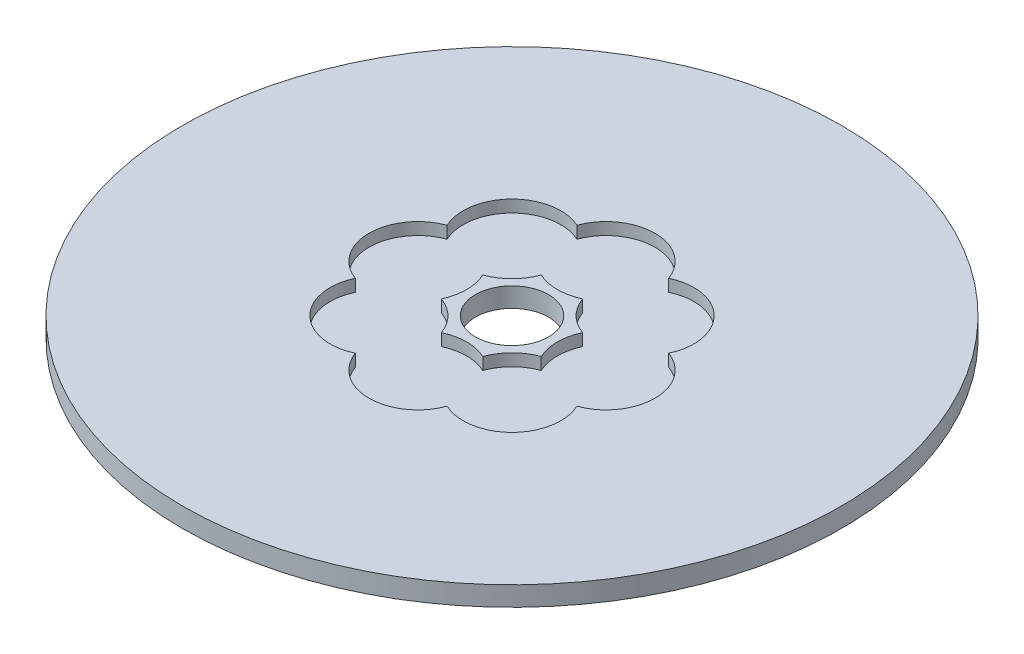
ISO-10303-21;
HEADER;
FILE_DESCRIPTION(('STEP AP214'),'2;1');
FILE_NAME('part.step','',(''),(''),'','','');
FILE_SCHEMA(('AUTOMOTIVE_DESIGN { 1 0 10303 214 1 1 1 1 }'));
ENDSEC;
DATA;
#1=APPLICATION_CONTEXT('core data for automotive mechanical design processes');
#2=APPLICATION_PROTOCOL_DEFINITION('international standard','automotive_design',2000,#1);
#3=PRODUCT_CONTEXT('',#1,'mechanical');
#4=PRODUCT('Part','Part','',(#3));
#5=PRODUCT_RELATED_PRODUCT_CATEGORY('part','',(#4));
#6=PRODUCT_DEFINITION_FORMATION('','',#4);
#7=PRODUCT_DEFINITION_CONTEXT('part definition',#1,'design');
#8=PRODUCT_DEFINITION('design','',#6,#7);
#9=PRODUCT_DEFINITION_SHAPE('','',#8);
#10=(LENGTH_UNIT() NAMED_UNIT(*) SI_UNIT(.MILLI.,.METRE.));
#11=(NAMED_UNIT(*) PLANE_ANGLE_UNIT() SI_UNIT($,.RADIAN.));
#12=(NAMED_UNIT(*) SI_UNIT($,.STERADIAN.) SOLID_ANGLE_UNIT());
#13=UNCERTAINTY_MEASURE_WITH_UNIT(LENGTH_MEASURE(1.E-05),#10,'distance_accuracy_value','');
#14=(GEOMETRIC_REPRESENTATION_CONTEXT(3) GLOBAL_UNCERTAINTY_ASSIGNED_CONTEXT((#13)) GLOBAL_UNIT_ASSIGNED_CONTEXT((#10,
#11,#12)) REPRESENTATION_CONTEXT('',''));
#15=CARTESIAN_POINT('',(0.,0.,0.));
#16=DIRECTION('',(0.,0.,1.));
#17=DIRECTION('',(1.,0.,0.));
#18=AXIS2_PLACEMENT_3D('',#15,#16,#17);
#19=CARTESIAN_POINT('',(0.,4.,0.));
#20=DIRECTION('',(0.,1.,0.));
#21=DIRECTION('',(0.,0.,1.));
#22=AXIS2_PLACEMENT_3D('',#19,#20,#21);
#23=PLANE('',#22);
#24=CARTESIAN_POINT('',(-13.6332998933664,4.,13.6332998933664));
#25=DIRECTION('',(0.,1.,0.));
#26=DIRECTION('',(0.707106781186549,0.,0.707106781186546));
#27=AXIS2_PLACEMENT_3D('',#24,#25,#26);
#28=CIRCLE('',#27,10.);
#29=CARTESIAN_POINT('',(-4.23358339935689,4.,10.2207744601651));
#30=VERTEX_POINT('',#29);
#31=CARTESIAN_POINT('',(-10.2207744601651,4.,4.23358339935693));
#32=VERTEX_POINT('',#31);
#33=EDGE_CURVE('E249',#30,#32,#28,.T.);
#34=ORIENTED_EDGE('',*,*,#33,.F.);
#35=CARTESIAN_POINT('',(0.,4.,19.2803976090984));
#36=DIRECTION('',(0.,1.,0.));
#37=DIRECTION('',(1.,0.,0.));
#38=AXIS2_PLACEMENT_3D('',#35,#36,#37);
#39=CIRCLE('',#38,10.);
#40=CARTESIAN_POINT('',(4.23358339935697,4.,10.220774460165));
#41=VERTEX_POINT('',#40);
#42=EDGE_CURVE('E227',#41,#30,#39,.T.);
#43=ORIENTED_EDGE('',*,*,#42,.F.);
#44=CARTESIAN_POINT('',(13.6332998933665,4.,13.6332998933663));
#45=DIRECTION('',(0.,1.,0.));
#46=DIRECTION('',(0.707106781186544,0.,-0.707106781186551));
#47=AXIS2_PLACEMENT_3D('',#44,#45,#46);
#48=CIRCLE('',#47,10.);
#49=CARTESIAN_POINT('',(10.220774460165,4.,4.23358339935688));
#50=VERTEX_POINT('',#49);
#51=EDGE_CURVE('E202',#50,#41,#48,.T.);
#52=ORIENTED_EDGE('',*,*,#51,.F.);
#53=CARTESIAN_POINT('',(19.2803976090984,4.,0.));
#54=DIRECTION('',(0.,1.,0.));
#55=DIRECTION('',(0.,0.,-1.));
#56=AXIS2_PLACEMENT_3D('',#53,#54,#55);
#57=CIRCLE('',#56,10.);
#58=CARTESIAN_POINT('',(10.2207744601651,4.,-4.23358339935698));
#59=VERTEX_POINT('',#58);
#60=EDGE_CURVE('E210',#59,#50,#57,.T.);
#61=ORIENTED_EDGE('',*,*,#60,.F.);
#62=CARTESIAN_POINT('',(13.6332998933663,4.,-13.6332998933665));
#63=DIRECTION('',(0.,1.,0.));
#64=DIRECTION('',(-0.707106781186554,0.,-0.707106781186541));
#65=AXIS2_PLACEMENT_3D('',#62,#63,#64);
#66=CIRCLE('',#65,10.);
#67=CARTESIAN_POINT('',(4.23358339935682,4.,-10.2207744601651));
#68=VERTEX_POINT('',#67);
#69=EDGE_CURVE('E190',#68,#59,#66,.T.);
#70=ORIENTED_EDGE('',*,*,#69,.F.);
#71=CARTESIAN_POINT('',(-2.01951445372929E-13,4.,-19.2803976090984));
#72=DIRECTION('',(0.,1.,0.));
#73=DIRECTION('',(-1.,0.,0.));
#74=AXIS2_PLACEMENT_3D('',#71,#72,#73);
#75=CIRCLE('',#74,10.);
#76=CARTESIAN_POINT('',(-4.23358339935704,4.,-10.220774460165));
#77=VERTEX_POINT('',#76);
#78=EDGE_CURVE('E164',#77,#68,#75,.T.);
#79=ORIENTED_EDGE('',*,*,#78,.F.);
#80=CARTESIAN_POINT('',(-13.6332998933666,4.,-13.6332998933662));
#81=DIRECTION('',(0.,1.,0.));
#82=DIRECTION('',(-0.707106781186539,0.,0.707106781186556));
#83=AXIS2_PLACEMENT_3D('',#80,#81,#82);
#84=CIRCLE('',#83,10.);
#85=CARTESIAN_POINT('',(-10.220774460165,4.,-4.23358339935683));
#86=VERTEX_POINT('',#85);
#87=EDGE_CURVE('E185',#86,#77,#84,.T.);
#88=ORIENTED_EDGE('',*,*,#87,.F.);
#89=CARTESIAN_POINT('',(-19.2803976090984,4.,0.));
#90=DIRECTION('',(0.,1.,0.));
#91=DIRECTION('',(0.,0.,1.));
#92=AXIS2_PLACEMENT_3D('',#89,#90,#91);
#93=CIRCLE('',#92,10.);
#94=EDGE_CURVE('E262',#32,#86,#93,.T.);
#95=ORIENTED_EDGE('',*,*,#94,.F.);
#96=EDGE_LOOP('',(#34,#43,#52,#61,#70,#79,#88,#95));
#97=FACE_BOUND('',#96,.T.);
#98=CARTESIAN_POINT('',(0.,4.,0.));
#99=DIRECTION('',(0.,1.,0.));
#100=DIRECTION('',(0.,0.,1.));
#101=AXIS2_PLACEMENT_3D('',#98,#99,#100);
#102=CIRCLE('',#101,7.5);
#103=CARTESIAN_POINT('',(0.,4.,7.5));
#104=VERTEX_POINT('',#103);
#105=EDGE_CURVE('E270',#104,#104,#102,.T.);
#106=ORIENTED_EDGE('',*,*,#105,.F.);
#107=EDGE_LOOP('',(#106));
#108=FACE_BOUND('',#107,.T.);
#109=ADVANCED_FACE('F39',(#97,#108),#23,.T.);
#110=CARTESIAN_POINT('',(-19.2803976090984,1.51424646369114,0.));
#111=DIRECTION('',(0.,1.,0.));
#112=DIRECTION('',(0.,0.,1.));
#113=AXIS2_PLACEMENT_3D('',#110,#111,#112);
#114=CYLINDRICAL_SURFACE('',#113,10.);
#115=CARTESIAN_POINT('',(-19.2803976090984,1.51424646369114,0.));
#116=DIRECTION('',(0.,1.,0.));
#117=DIRECTION('',(0.,0.,1.));
#118=AXIS2_PLACEMENT_3D('',#115,#116,#117);
#119=CIRCLE('',#118,10.);
#120=CARTESIAN_POINT('',(-10.2207744601651,1.51424646369114,4.23358339935693));
#121=VERTEX_POINT('',#120);
#122=CARTESIAN_POINT('',(-10.220774460165,1.51424646369114,-4.23358339935683));
#123=VERTEX_POINT('',#122);
#124=EDGE_CURVE('E259',#121,#123,#119,.T.);
#125=ORIENTED_EDGE('',*,*,#124,.F.);
#126=DIRECTION('',(0.,1.,0.));
#127=VECTOR('',#126,1.);
#128=CARTESIAN_POINT('',(-10.2207744601651,2.75712323184557,4.23358339935693));
#129=LINE('',#128,#127);
#130=EDGE_CURVE('E254',#121,#32,#129,.T.);
#131=ORIENTED_EDGE('',*,*,#130,.T.);
#132=ORIENTED_EDGE('',*,*,#94,.T.);
#133=DIRECTION('',(0.,1.,0.));
#134=VECTOR('',#133,1.);
#135=CARTESIAN_POINT('',(-10.220774460165,2.75712323184557,-4.23358339935683));
#136=LINE('',#135,#134);
#137=EDGE_CURVE('E247',#86,#123,#136,.F.);
#138=ORIENTED_EDGE('',*,*,#137,.T.);
#139=EDGE_LOOP('',(#125,#131,#132,#138));
#140=FACE_BOUND('',#139,.T.);
#141=ADVANCED_FACE('F287',(#140),#114,.F.);
#142=CARTESIAN_POINT('',(0.,4.,0.));
#143=DIRECTION('',(0.,-1.,0.));
#144=DIRECTION('',(0.,0.,-1.));
#145=AXIS2_PLACEMENT_3D('',#142,#143,#144);
#146=CYLINDRICAL_SURFACE('',#145,67.5);
#147=CARTESIAN_POINT('',(0.,4.,0.));
#148=DIRECTION('',(0.,1.,0.));
#149=DIRECTION('',(0.,0.,1.));
#150=AXIS2_PLACEMENT_3D('',#147,#148,#149);
#151=CIRCLE('',#150,67.5);
#152=CARTESIAN_POINT('',(0.,4.,67.5));
#153=VERTEX_POINT('',#152);
#154=EDGE_CURVE('E11',#153,#153,#151,.T.);
#155=ORIENTED_EDGE('',*,*,#154,.F.);
#156=EDGE_LOOP('',(#155));
#157=FACE_BOUND('',#156,.T.);
#158=CARTESIAN_POINT('',(0.,0.,0.));
#159=DIRECTION('',(0.,1.,0.));
#160=DIRECTION('',(0.,0.,1.));
#161=AXIS2_PLACEMENT_3D('',#158,#159,#160);
#162=CIRCLE('',#161,67.5);
#163=CARTESIAN_POINT('',(0.,0.,67.5));
#164=VERTEX_POINT('',#163);
#165=EDGE_CURVE('E43',#164,#164,#162,.T.);
#166=ORIENTED_EDGE('',*,*,#165,.T.);
#167=EDGE_LOOP('',(#166));
#168=FACE_BOUND('',#167,.T.);
#169=ADVANCED_FACE('F41',(#157,#168),#146,.T.);
#170=CARTESIAN_POINT('',(-22.6929230422997,4.,9.3997164940095));
#171=VERTEX_POINT('',#170);
#172=CARTESIAN_POINT('',(-9.39971649400942,4.,22.6929230422998));
#173=VERTEX_POINT('',#172);
#174=EDGE_CURVE('E243',#171,#173,#28,.T.);
#175=ORIENTED_EDGE('',*,*,#174,.F.);
#176=CARTESIAN_POINT('',(-22.6929230423,4.,-9.39971649400941));
#177=VERTEX_POINT('',#176);
#178=EDGE_CURVE('E256',#177,#171,#93,.T.);
#179=ORIENTED_EDGE('',*,*,#178,.F.);
#180=CARTESIAN_POINT('',(-9.39971649400973,4.,-22.6929230422997));
#181=VERTEX_POINT('',#180);
#182=EDGE_CURVE('E179',#181,#177,#84,.T.);
#183=ORIENTED_EDGE('',*,*,#182,.F.);
#184=CARTESIAN_POINT('',(9.39971649400926,4.,-22.6929230422998));
#185=VERTEX_POINT('',#184);
#186=EDGE_CURVE('E171',#185,#181,#75,.T.);
#187=ORIENTED_EDGE('',*,*,#186,.F.);
#188=CARTESIAN_POINT('',(22.6929230422996,4.,-9.39971649400954));
#189=VERTEX_POINT('',#188);
#190=EDGE_CURVE('E192',#189,#185,#66,.T.);
#191=ORIENTED_EDGE('',*,*,#190,.F.);
#192=CARTESIAN_POINT('',(22.6929230422999,4.,9.39971649400945));
#193=VERTEX_POINT('',#192);
#194=EDGE_CURVE('E203',#193,#189,#57,.T.);
#195=ORIENTED_EDGE('',*,*,#194,.F.);
#196=CARTESIAN_POINT('',(9.39971649400958,4.,22.6929230422997));
#197=VERTEX_POINT('',#196);
#198=EDGE_CURVE('E212',#197,#193,#48,.T.);
#199=ORIENTED_EDGE('',*,*,#198,.F.);
#200=EDGE_CURVE('E225',#173,#197,#39,.T.);
#201=ORIENTED_EDGE('',*,*,#200,.F.);
#202=EDGE_LOOP('',(#175,#179,#183,#187,#191,#195,#199,#201));
#203=FACE_BOUND('',#202,.T.);
#204=ORIENTED_EDGE('',*,*,#154,.T.);
#205=EDGE_LOOP('',(#204));
#206=FACE_BOUND('',#205,.T.);
#207=ADVANCED_FACE('F288',(#203,#206),#23,.T.);
#208=CARTESIAN_POINT('',(0.,0.,0.));
#209=DIRECTION('',(0.,1.,0.));
#210=DIRECTION('',(0.,0.,1.));
#211=AXIS2_PLACEMENT_3D('',#208,#209,#210);
#212=PLANE('',#211);
#213=CARTESIAN_POINT('',(0.,0.,0.));
#214=DIRECTION('',(0.,1.,0.));
#215=DIRECTION('',(0.,0.,1.));
#216=AXIS2_PLACEMENT_3D('',#213,#214,#215);
#217=CIRCLE('',#216,7.5);
#218=CARTESIAN_POINT('',(0.,0.,7.5));
#219=VERTEX_POINT('',#218);
#220=EDGE_CURVE('E265',#219,#219,#217,.T.);
#221=ORIENTED_EDGE('',*,*,#220,.T.);
#222=EDGE_LOOP('',(#221));
#223=FACE_BOUND('',#222,.T.);
#224=ORIENTED_EDGE('',*,*,#165,.F.);
#225=EDGE_LOOP('',(#224));
#226=FACE_BOUND('',#225,.T.);
#227=ADVANCED_FACE('F272',(#223,#226),#212,.F.);
#228=CARTESIAN_POINT('',(0.,4.,0.));
#229=DIRECTION('',(0.,-1.,0.));
#230=DIRECTION('',(0.,0.,-1.));
#231=AXIS2_PLACEMENT_3D('',#228,#229,#230);
#232=CYLINDRICAL_SURFACE('',#231,7.5);
#233=ORIENTED_EDGE('',*,*,#105,.T.);
#234=EDGE_LOOP('',(#233));
#235=FACE_BOUND('',#234,.T.);
#236=ORIENTED_EDGE('',*,*,#220,.F.);
#237=EDGE_LOOP('',(#236));
#238=FACE_BOUND('',#237,.T.);
#239=ADVANCED_FACE('F277',(#235,#238),#232,.F.);
#240=ORIENTED_EDGE('',*,*,#178,.T.);
#241=DIRECTION('',(0.,1.,0.));
#242=VECTOR('',#241,1.);
#243=CARTESIAN_POINT('',(-22.6929230422997,2.75712323184557,9.3997164940095));
#244=LINE('',#243,#242);
#245=CARTESIAN_POINT('',(-22.6929230422997,1.51424646369114,9.3997164940095));
#246=VERTEX_POINT('',#245);
#247=EDGE_CURVE('E65',#171,#246,#244,.F.);
#248=ORIENTED_EDGE('',*,*,#247,.T.);
#249=CARTESIAN_POINT('',(-22.6929230423,1.51424646369114,-9.39971649400941));
#250=VERTEX_POINT('',#249);
#251=EDGE_CURVE('E263',#250,#246,#119,.T.);
#252=ORIENTED_EDGE('',*,*,#251,.F.);
#253=DIRECTION('',(0.,1.,0.));
#254=VECTOR('',#253,1.);
#255=CARTESIAN_POINT('',(-22.6929230423,2.75712323184557,-9.39971649400941));
#256=LINE('',#255,#254);
#257=EDGE_CURVE('E177',#250,#177,#256,.T.);
#258=ORIENTED_EDGE('',*,*,#257,.T.);
#259=EDGE_LOOP('',(#240,#248,#252,#258));
#260=FACE_BOUND('',#259,.T.);
#261=ADVANCED_FACE('F279',(#260),#114,.F.);
#262=CARTESIAN_POINT('',(-19.2803976090984,1.51424646369114,0.));
#263=DIRECTION('',(0.,1.,0.));
#264=DIRECTION('',(0.,0.,1.));
#265=AXIS2_PLACEMENT_3D('',#262,#263,#264);
#266=PLANE('',#265);
#267=CARTESIAN_POINT('',(-13.6332998933666,1.51424646369114,-13.6332998933662));
#268=DIRECTION('',(0.,1.,0.));
#269=DIRECTION('',(-0.707106781186539,0.,0.707106781186556));
#270=AXIS2_PLACEMENT_3D('',#267,#268,#269);
#271=CIRCLE('',#270,10.);
#272=CARTESIAN_POINT('',(-9.39971649400973,1.51424646369114,-22.6929230422997));
#273=VERTEX_POINT('',#272);
#274=EDGE_CURVE('E158',#273,#250,#271,.T.);
#275=ORIENTED_EDGE('',*,*,#274,.T.);
#276=ORIENTED_EDGE('',*,*,#251,.T.);
#277=CARTESIAN_POINT('',(-13.6332998933664,1.51424646369114,13.6332998933664));
#278=DIRECTION('',(0.,1.,0.));
#279=DIRECTION('',(0.707106781186549,0.,0.707106781186546));
#280=AXIS2_PLACEMENT_3D('',#277,#278,#279);
#281=CIRCLE('',#280,10.);
#282=CARTESIAN_POINT('',(-9.39971649400942,1.51424646369114,22.6929230422998));
#283=VERTEX_POINT('',#282);
#284=EDGE_CURVE('E248',#246,#283,#281,.T.);
#285=ORIENTED_EDGE('',*,*,#284,.T.);
#286=CARTESIAN_POINT('',(0.,1.51424646369114,19.2803976090984));
#287=DIRECTION('',(0.,1.,0.));
#288=DIRECTION('',(1.,0.,0.));
#289=AXIS2_PLACEMENT_3D('',#286,#287,#288);
#290=CIRCLE('',#289,10.);
#291=CARTESIAN_POINT('',(9.39971649400958,1.51424646369114,22.6929230422997));
#292=VERTEX_POINT('',#291);
#293=EDGE_CURVE('E230',#283,#292,#290,.T.);
#294=ORIENTED_EDGE('',*,*,#293,.T.);
#295=CARTESIAN_POINT('',(13.6332998933665,1.51424646369114,13.6332998933663));
#296=DIRECTION('',(0.,1.,0.));
#297=DIRECTION('',(0.707106781186544,0.,-0.707106781186551));
#298=AXIS2_PLACEMENT_3D('',#295,#296,#297);
#299=CIRCLE('',#298,10.);
#300=CARTESIAN_POINT('',(22.6929230422999,1.51424646369114,9.39971649400945));
#301=VERTEX_POINT('',#300);
#302=EDGE_CURVE('E209',#292,#301,#299,.T.);
#303=ORIENTED_EDGE('',*,*,#302,.T.);
#304=CARTESIAN_POINT('',(19.2803976090984,1.51424646369114,0.));
#305=DIRECTION('',(0.,1.,0.));
#306=DIRECTION('',(0.,0.,-1.));
#307=AXIS2_PLACEMENT_3D('',#304,#305,#306);
#308=CIRCLE('',#307,10.);
#309=CARTESIAN_POINT('',(22.6929230422996,1.51424646369114,-9.39971649400954));
#310=VERTEX_POINT('',#309);
#311=EDGE_CURVE('E206',#301,#310,#308,.T.);
#312=ORIENTED_EDGE('',*,*,#311,.T.);
#313=CARTESIAN_POINT('',(13.6332998933663,1.51424646369114,-13.6332998933665));
#314=DIRECTION('',(0.,1.,0.));
#315=DIRECTION('',(-0.707106781186554,0.,-0.707106781186541));
#316=AXIS2_PLACEMENT_3D('',#313,#314,#315);
#317=CIRCLE('',#316,10.);
#318=CARTESIAN_POINT('',(9.39971649400926,1.51424646369114,-22.6929230422998));
#319=VERTEX_POINT('',#318);
#320=EDGE_CURVE('E161',#310,#319,#317,.T.);
#321=ORIENTED_EDGE('',*,*,#320,.T.);
#322=CARTESIAN_POINT('',(-2.01951445372929E-13,1.51424646369114,-19.2803976090984));
#323=DIRECTION('',(0.,1.,0.));
#324=DIRECTION('',(-1.,0.,0.));
#325=AXIS2_PLACEMENT_3D('',#322,#323,#324);
#326=CIRCLE('',#325,10.);
#327=EDGE_CURVE('E155',#319,#273,#326,.T.);
#328=ORIENTED_EDGE('',*,*,#327,.T.);
#329=EDGE_LOOP('',(#275,#276,#285,#294,#303,#312,#321,#328));
#330=FACE_BOUND('',#329,.T.);
#331=ORIENTED_EDGE('',*,*,#124,.T.);
#332=CARTESIAN_POINT('',(-4.23358339935704,1.51424646369114,-10.220774460165));
#333=VERTEX_POINT('',#332);
#334=EDGE_CURVE('E53',#123,#333,#271,.T.);
#335=ORIENTED_EDGE('',*,*,#334,.T.);
#336=CARTESIAN_POINT('',(4.23358339935682,1.51424646369114,-10.2207744601651));
#337=VERTEX_POINT('',#336);
#338=EDGE_CURVE('E163',#333,#337,#326,.T.);
#339=ORIENTED_EDGE('',*,*,#338,.T.);
#340=CARTESIAN_POINT('',(10.2207744601651,1.51424646369114,-4.23358339935698));
#341=VERTEX_POINT('',#340);
#342=EDGE_CURVE('E195',#337,#341,#317,.T.);
#343=ORIENTED_EDGE('',*,*,#342,.T.);
#344=CARTESIAN_POINT('',(10.220774460165,1.51424646369114,4.23358339935688));
#345=VERTEX_POINT('',#344);
#346=EDGE_CURVE('E205',#341,#345,#308,.T.);
#347=ORIENTED_EDGE('',*,*,#346,.T.);
#348=CARTESIAN_POINT('',(4.23358339935697,1.51424646369114,10.220774460165));
#349=VERTEX_POINT('',#348);
#350=EDGE_CURVE('E213',#345,#349,#299,.T.);
#351=ORIENTED_EDGE('',*,*,#350,.T.);
#352=CARTESIAN_POINT('',(-4.23358339935689,1.51424646369114,10.2207744601651));
#353=VERTEX_POINT('',#352);
#354=EDGE_CURVE('E224',#349,#353,#290,.T.);
#355=ORIENTED_EDGE('',*,*,#354,.T.);
#356=EDGE_CURVE('E244',#353,#121,#281,.T.);
#357=ORIENTED_EDGE('',*,*,#356,.T.);
#358=EDGE_LOOP('',(#331,#335,#339,#343,#347,#351,#355,#357));
#359=FACE_BOUND('',#358,.T.);
#360=ADVANCED_FACE('F152',(#330,#359),#266,.T.);
#361=CARTESIAN_POINT('',(-13.6332998933664,1.51424646369114,13.6332998933664));
#362=DIRECTION('',(0.,1.,0.));
#363=DIRECTION('',(0.,0.,1.));
#364=AXIS2_PLACEMENT_3D('',#361,#362,#363);
#365=CYLINDRICAL_SURFACE('',#364,10.);
#366=ORIENTED_EDGE('',*,*,#356,.F.);
#367=DIRECTION('',(0.,1.,0.));
#368=VECTOR('',#367,1.);
#369=CARTESIAN_POINT('',(-4.23358339935689,2.75712323184557,10.2207744601651));
#370=LINE('',#369,#368);
#371=EDGE_CURVE('E245',#353,#30,#370,.T.);
#372=ORIENTED_EDGE('',*,*,#371,.T.);
#373=ORIENTED_EDGE('',*,*,#33,.T.);
#374=ORIENTED_EDGE('',*,*,#130,.F.);
#375=EDGE_LOOP('',(#366,#372,#373,#374));
#376=FACE_BOUND('',#375,.T.);
#377=ADVANCED_FACE('F375',(#376),#365,.F.);
#378=ORIENTED_EDGE('',*,*,#174,.T.);
#379=DIRECTION('',(0.,1.,0.));
#380=VECTOR('',#379,1.);
#381=CARTESIAN_POINT('',(-9.39971649400942,2.75712323184557,22.6929230422998));
#382=LINE('',#381,#380);
#383=EDGE_CURVE('E239',#173,#283,#382,.F.);
#384=ORIENTED_EDGE('',*,*,#383,.T.);
#385=ORIENTED_EDGE('',*,*,#284,.F.);
#386=ORIENTED_EDGE('',*,*,#247,.F.);
#387=EDGE_LOOP('',(#378,#384,#385,#386));
#388=FACE_BOUND('',#387,.T.);
#389=ADVANCED_FACE('F312',(#388),#365,.F.);
#390=CARTESIAN_POINT('',(-13.6332998933666,1.51424646369114,-13.6332998933662));
#391=DIRECTION('',(0.,1.,0.));
#392=DIRECTION('',(0.,0.,1.));
#393=AXIS2_PLACEMENT_3D('',#390,#391,#392);
#394=CYLINDRICAL_SURFACE('',#393,10.);
#395=ORIENTED_EDGE('',*,*,#274,.F.);
#396=DIRECTION('',(0.,1.,0.));
#397=VECTOR('',#396,1.);
#398=CARTESIAN_POINT('',(-9.39971649400973,2.75712323184557,-22.6929230422997));
#399=LINE('',#398,#397);
#400=EDGE_CURVE('E169',#181,#273,#399,.F.);
#401=ORIENTED_EDGE('',*,*,#400,.F.);
#402=ORIENTED_EDGE('',*,*,#182,.T.);
#403=ORIENTED_EDGE('',*,*,#257,.F.);
#404=EDGE_LOOP('',(#395,#401,#402,#403));
#405=FACE_BOUND('',#404,.T.);
#406=ADVANCED_FACE('F176',(#405),#394,.F.);
#407=ORIENTED_EDGE('',*,*,#87,.T.);
#408=DIRECTION('',(0.,1.,0.));
#409=VECTOR('',#408,1.);
#410=CARTESIAN_POINT('',(-4.23358339935704,2.75712323184557,-10.220774460165));
#411=LINE('',#410,#409);
#412=EDGE_CURVE('E173',#333,#77,#411,.T.);
#413=ORIENTED_EDGE('',*,*,#412,.F.);
#414=ORIENTED_EDGE('',*,*,#334,.F.);
#415=ORIENTED_EDGE('',*,*,#137,.F.);
#416=EDGE_LOOP('',(#407,#413,#414,#415));
#417=FACE_BOUND('',#416,.T.);
#418=ADVANCED_FACE('F355',(#417),#394,.F.);
#419=CARTESIAN_POINT('',(0.,1.51424646369114,19.2803976090984));
#420=DIRECTION('',(0.,1.,0.));
#421=DIRECTION('',(0.,0.,1.));
#422=AXIS2_PLACEMENT_3D('',#419,#420,#421);
#423=CYLINDRICAL_SURFACE('',#422,10.);
#424=ORIENTED_EDGE('',*,*,#354,.F.);
#425=DIRECTION('',(0.,1.,0.));
#426=VECTOR('',#425,1.);
#427=CARTESIAN_POINT('',(4.23358339935696,2.75712323184557,10.220774460165));
#428=LINE('',#427,#426);
#429=EDGE_CURVE('E218',#349,#41,#428,.T.);
#430=ORIENTED_EDGE('',*,*,#429,.T.);
#431=ORIENTED_EDGE('',*,*,#42,.T.);
#432=ORIENTED_EDGE('',*,*,#371,.F.);
#433=EDGE_LOOP('',(#424,#430,#431,#432));
#434=FACE_BOUND('',#433,.T.);
#435=ADVANCED_FACE('F343',(#434),#423,.F.);
#436=CARTESIAN_POINT('',(13.6332998933663,1.51424646369114,-13.6332998933665));
#437=DIRECTION('',(0.,1.,0.));
#438=DIRECTION('',(0.,0.,1.));
#439=AXIS2_PLACEMENT_3D('',#436,#437,#438);
#440=CYLINDRICAL_SURFACE('',#439,10.);
#441=DIRECTION('',(0.,1.,0.));
#442=VECTOR('',#441,1.);
#443=CARTESIAN_POINT('',(4.23358339935682,2.75712323184557,-10.2207744601651));
#444=LINE('',#443,#442);
#445=EDGE_CURVE('E240',#337,#68,#444,.T.);
#446=ORIENTED_EDGE('',*,*,#445,.T.);
#447=ORIENTED_EDGE('',*,*,#69,.T.);
#448=DIRECTION('',(0.,1.,0.));
#449=VECTOR('',#448,1.);
#450=CARTESIAN_POINT('',(10.2207744601651,2.75712323184557,-4.23358339935698));
#451=LINE('',#450,#449);
#452=EDGE_CURVE('E196',#341,#59,#451,.T.);
#453=ORIENTED_EDGE('',*,*,#452,.F.);
#454=ORIENTED_EDGE('',*,*,#342,.F.);
#455=EDGE_LOOP('',(#446,#447,#453,#454));
#456=FACE_BOUND('',#455,.T.);
#457=ADVANCED_FACE('F334',(#456),#440,.F.);
#458=CARTESIAN_POINT('',(13.6332998933665,1.51424646369114,13.6332998933663));
#459=DIRECTION('',(0.,1.,0.));
#460=DIRECTION('',(0.,0.,1.));
#461=AXIS2_PLACEMENT_3D('',#458,#459,#460);
#462=CYLINDRICAL_SURFACE('',#461,10.);
#463=DIRECTION('',(0.,1.,0.));
#464=VECTOR('',#463,1.);
#465=CARTESIAN_POINT('',(10.220774460165,2.75712323184557,4.23358339935688));
#466=LINE('',#465,#464);
#467=EDGE_CURVE('E232',#345,#50,#466,.T.);
#468=ORIENTED_EDGE('',*,*,#467,.T.);
#469=ORIENTED_EDGE('',*,*,#51,.T.);
#470=ORIENTED_EDGE('',*,*,#429,.F.);
#471=ORIENTED_EDGE('',*,*,#350,.F.);
#472=EDGE_LOOP('',(#468,#469,#470,#471));
#473=FACE_BOUND('',#472,.T.);
#474=ADVANCED_FACE('F342',(#473),#462,.F.);
#475=ORIENTED_EDGE('',*,*,#200,.T.);
#476=DIRECTION('',(0.,1.,0.));
#477=VECTOR('',#476,1.);
#478=CARTESIAN_POINT('',(9.39971649400958,2.75712323184557,22.6929230422997));
#479=LINE('',#478,#477);
#480=EDGE_CURVE('E215',#197,#292,#479,.F.);
#481=ORIENTED_EDGE('',*,*,#480,.T.);
#482=ORIENTED_EDGE('',*,*,#293,.F.);
#483=ORIENTED_EDGE('',*,*,#383,.F.);
#484=EDGE_LOOP('',(#475,#481,#482,#483));
#485=FACE_BOUND('',#484,.T.);
#486=ADVANCED_FACE('F320',(#485),#423,.F.);
#487=DIRECTION('',(0.,1.,0.));
#488=VECTOR('',#487,1.);
#489=CARTESIAN_POINT('',(22.6929230422999,2.75712323184557,9.39971649400945));
#490=LINE('',#489,#488);
#491=EDGE_CURVE('E226',#193,#301,#490,.F.);
#492=ORIENTED_EDGE('',*,*,#491,.T.);
#493=ORIENTED_EDGE('',*,*,#302,.F.);
#494=ORIENTED_EDGE('',*,*,#480,.F.);
#495=ORIENTED_EDGE('',*,*,#198,.T.);
#496=EDGE_LOOP('',(#492,#493,#494,#495));
#497=FACE_BOUND('',#496,.T.);
#498=ADVANCED_FACE('F321',(#497),#462,.F.);
#499=CARTESIAN_POINT('',(19.2803976090984,1.51424646369114,0.));
#500=DIRECTION('',(0.,1.,0.));
#501=DIRECTION('',(0.,0.,1.));
#502=AXIS2_PLACEMENT_3D('',#499,#500,#501);
#503=CYLINDRICAL_SURFACE('',#502,10.);
#504=ORIENTED_EDGE('',*,*,#346,.F.);
#505=ORIENTED_EDGE('',*,*,#452,.T.);
#506=ORIENTED_EDGE('',*,*,#60,.T.);
#507=ORIENTED_EDGE('',*,*,#467,.F.);
#508=EDGE_LOOP('',(#504,#505,#506,#507));
#509=FACE_BOUND('',#508,.T.);
#510=ADVANCED_FACE('F339',(#509),#503,.F.);
#511=ORIENTED_EDGE('',*,*,#194,.T.);
#512=DIRECTION('',(0.,1.,0.));
#513=VECTOR('',#512,1.);
#514=CARTESIAN_POINT('',(22.6929230422996,2.75712323184557,-9.39971649400954));
#515=LINE('',#514,#513);
#516=EDGE_CURVE('E191',#189,#310,#515,.F.);
#517=ORIENTED_EDGE('',*,*,#516,.T.);
#518=ORIENTED_EDGE('',*,*,#311,.F.);
#519=ORIENTED_EDGE('',*,*,#491,.F.);
#520=EDGE_LOOP('',(#511,#517,#518,#519));
#521=FACE_BOUND('',#520,.T.);
#522=ADVANCED_FACE('F324',(#521),#503,.F.);
#523=DIRECTION('',(0.,1.,0.));
#524=VECTOR('',#523,1.);
#525=CARTESIAN_POINT('',(9.39971649400926,2.75712323184557,-22.6929230422998));
#526=LINE('',#525,#524);
#527=EDGE_CURVE('E234',#185,#319,#526,.F.);
#528=ORIENTED_EDGE('',*,*,#527,.T.);
#529=ORIENTED_EDGE('',*,*,#320,.F.);
#530=ORIENTED_EDGE('',*,*,#516,.F.);
#531=ORIENTED_EDGE('',*,*,#190,.T.);
#532=EDGE_LOOP('',(#528,#529,#530,#531));
#533=FACE_BOUND('',#532,.T.);
#534=ADVANCED_FACE('F328',(#533),#440,.F.);
#535=CARTESIAN_POINT('',(-2.01951445372929E-13,1.51424646369114,-19.2803976090984));
#536=DIRECTION('',(0.,1.,0.));
#537=DIRECTION('',(0.,0.,1.));
#538=AXIS2_PLACEMENT_3D('',#535,#536,#537);
#539=CYLINDRICAL_SURFACE('',#538,10.);
#540=ORIENTED_EDGE('',*,*,#338,.F.);
#541=ORIENTED_EDGE('',*,*,#412,.T.);
#542=ORIENTED_EDGE('',*,*,#78,.T.);
#543=ORIENTED_EDGE('',*,*,#445,.F.);
#544=EDGE_LOOP('',(#540,#541,#542,#543));
#545=FACE_BOUND('',#544,.T.);
#546=ADVANCED_FACE('F332',(#545),#539,.F.);
#547=ORIENTED_EDGE('',*,*,#186,.T.);
#548=ORIENTED_EDGE('',*,*,#400,.T.);
#549=ORIENTED_EDGE('',*,*,#327,.F.);
#550=ORIENTED_EDGE('',*,*,#527,.F.);
#551=EDGE_LOOP('',(#547,#548,#549,#550));
#552=FACE_BOUND('',#551,.T.);
#553=ADVANCED_FACE('F166',(#552),#539,.F.);
#554=CLOSED_SHELL('',(#109,#141,#169,#207,#227,#239,#261,#360,#377,#389,#406,#418,#435,#457,
#474,#486,#498,#510,#522,#534,#546,#553));
#555=MANIFOLD_SOLID_BREP('B2',#554);
#556=ADVANCED_BREP_SHAPE_REPRESENTATION('',(#18,#555),#14);
#557=SHAPE_DEFINITION_REPRESENTATION(#9,#556);
ENDSEC;
END-ISO-10303-21;
